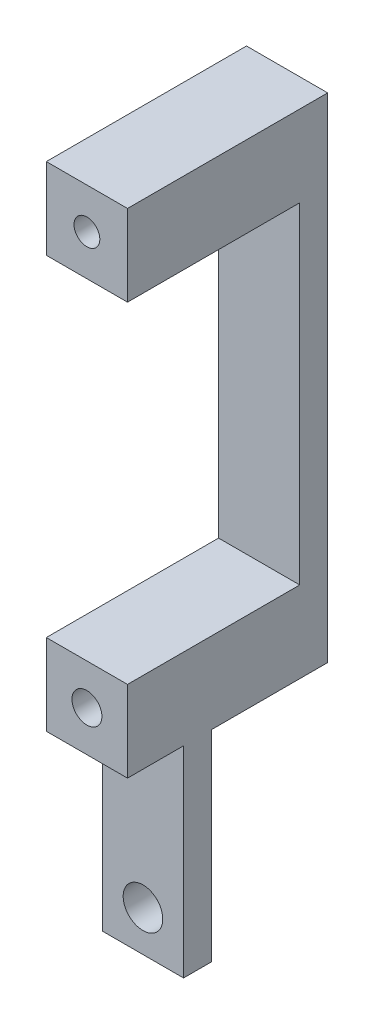
ISO-10303-21;
HEADER;
FILE_DESCRIPTION(('STEP AP214'),'2;1');
FILE_NAME('part.step','',(''),(''),'','','');
FILE_SCHEMA(('AUTOMOTIVE_DESIGN { 1 0 10303 214 1 1 1 1 }'));
ENDSEC;
DATA;
#1=APPLICATION_CONTEXT('core data for automotive mechanical design processes');
#2=APPLICATION_PROTOCOL_DEFINITION('international standard','automotive_design',2000,#1);
#3=PRODUCT_CONTEXT('',#1,'mechanical');
#4=PRODUCT('Part','Part','',(#3));
#5=PRODUCT_RELATED_PRODUCT_CATEGORY('part','',(#4));
#6=PRODUCT_DEFINITION_FORMATION('','',#4);
#7=PRODUCT_DEFINITION_CONTEXT('part definition',#1,'design');
#8=PRODUCT_DEFINITION('design','',#6,#7);
#9=PRODUCT_DEFINITION_SHAPE('','',#8);
#10=(LENGTH_UNIT() NAMED_UNIT(*) SI_UNIT(.MILLI.,.METRE.));
#11=(NAMED_UNIT(*) PLANE_ANGLE_UNIT() SI_UNIT($,.RADIAN.));
#12=(NAMED_UNIT(*) SI_UNIT($,.STERADIAN.) SOLID_ANGLE_UNIT());
#13=UNCERTAINTY_MEASURE_WITH_UNIT(LENGTH_MEASURE(1.E-05),#10,'distance_accuracy_value','');
#14=(GEOMETRIC_REPRESENTATION_CONTEXT(3) GLOBAL_UNCERTAINTY_ASSIGNED_CONTEXT((#13)) GLOBAL_UNIT_ASSIGNED_CONTEXT((#10,
#11,#12)) REPRESENTATION_CONTEXT('',''));
#15=CARTESIAN_POINT('',(0.,0.,0.));
#16=DIRECTION('',(0.,0.,1.));
#17=DIRECTION('',(1.,0.,0.));
#18=AXIS2_PLACEMENT_3D('',#15,#16,#17);
#19=CARTESIAN_POINT('',(0.,118.4148,-15.0495));
#20=DIRECTION('',(0.,0.,-1.));
#21=DIRECTION('',(-1.,0.,0.));
#22=AXIS2_PLACEMENT_3D('',#19,#20,#21);
#23=PLANE('',#22);
#24=DIRECTION('',(1.,0.,0.));
#25=VECTOR('',#24,1.);
#26=CARTESIAN_POINT('',(0.,104.5718,-15.0495));
#27=LINE('',#26,#25);
#28=CARTESIAN_POINT('',(0.,104.5718,-15.0495));
#29=VERTEX_POINT('',#28);
#30=CARTESIAN_POINT('',(13.843,104.5718,-15.0495));
#31=VERTEX_POINT('',#30);
#32=EDGE_CURVE('E269',#29,#31,#27,.T.);
#33=ORIENTED_EDGE('',*,*,#32,.F.);
#34=DIRECTION('',(0.,-1.,0.));
#35=VECTOR('',#34,1.);
#36=CARTESIAN_POINT('',(0.,118.4148,-15.0495));
#37=LINE('',#36,#35);
#38=CARTESIAN_POINT('',(0.,48.133,-15.0495));
#39=VERTEX_POINT('',#38);
#40=EDGE_CURVE('E64',#29,#39,#37,.T.);
#41=ORIENTED_EDGE('',*,*,#40,.T.);
#42=DIRECTION('',(1.,0.,0.));
#43=VECTOR('',#42,1.);
#44=CARTESIAN_POINT('',(0.,48.133,-15.0495));
#45=LINE('',#44,#43);
#46=CARTESIAN_POINT('',(13.843,48.133,-15.0495));
#47=VERTEX_POINT('',#46);
#48=EDGE_CURVE('E305',#39,#47,#45,.T.);
#49=ORIENTED_EDGE('',*,*,#48,.T.);
#50=DIRECTION('',(0.,-1.,0.));
#51=VECTOR('',#50,1.);
#52=CARTESIAN_POINT('',(13.843,118.4148,-15.0495));
#53=LINE('',#52,#51);
#54=EDGE_CURVE('E317',#31,#47,#53,.T.);
#55=ORIENTED_EDGE('',*,*,#54,.F.);
#56=EDGE_LOOP('',(#33,#41,#49,#55));
#57=FACE_BOUND('',#56,.T.);
#58=ADVANCED_FACE('F39',(#57),#23,.F.);
#59=CARTESIAN_POINT('',(0.,48.133,4.7625));
#60=DIRECTION('',(0.,-1.,0.));
#61=DIRECTION('',(0.,0.,-1.));
#62=AXIS2_PLACEMENT_3D('',#59,#60,#61);
#63=PLANE('',#62);
#64=ORIENTED_EDGE('',*,*,#48,.F.);
#65=DIRECTION('',(0.,0.,-1.));
#66=VECTOR('',#65,1.);
#67=CARTESIAN_POINT('',(0.,48.133,4.7625));
#68=LINE('',#67,#66);
#69=CARTESIAN_POINT('',(0.,48.133,14.31925));
#70=VERTEX_POINT('',#69);
#71=EDGE_CURVE('E462',#70,#39,#68,.T.);
#72=ORIENTED_EDGE('',*,*,#71,.F.);
#73=DIRECTION('',(-1.,0.,0.));
#74=VECTOR('',#73,1.);
#75=CARTESIAN_POINT('',(0.,48.133,14.31925));
#76=LINE('',#75,#74);
#77=CARTESIAN_POINT('',(13.843,48.133,14.31925));
#78=VERTEX_POINT('',#77);
#79=EDGE_CURVE('E436',#78,#70,#76,.T.);
#80=ORIENTED_EDGE('',*,*,#79,.F.);
#81=DIRECTION('',(0.,0.,-1.));
#82=VECTOR('',#81,1.);
#83=CARTESIAN_POINT('',(13.843,48.133,4.7625));
#84=LINE('',#83,#82);
#85=EDGE_CURVE('E474',#78,#47,#84,.T.);
#86=ORIENTED_EDGE('',*,*,#85,.T.);
#87=EDGE_LOOP('',(#64,#72,#80,#86));
#88=FACE_BOUND('',#87,.T.);
#89=ADVANCED_FACE('F515',(#88),#63,.F.);
#90=CARTESIAN_POINT('',(0.,0.,4.7625));
#91=DIRECTION('',(0.,0.,-1.));
#92=DIRECTION('',(-1.,0.,0.));
#93=AXIS2_PLACEMENT_3D('',#90,#91,#92);
#94=PLANE('',#93);
#95=CARTESIAN_POINT('',(6.9215,6.9215,4.7625));
#96=DIRECTION('',(0.,0.,-1.));
#97=DIRECTION('',(-1.,0.,0.));
#98=AXIS2_PLACEMENT_3D('',#95,#96,#97);
#99=CIRCLE('',#98,3.3782);
#100=CARTESIAN_POINT('',(3.5433,6.9215,4.7625));
#101=VERTEX_POINT('',#100);
#102=EDGE_CURVE('E420',#101,#101,#99,.T.);
#103=ORIENTED_EDGE('',*,*,#102,.T.);
#104=EDGE_LOOP('',(#103));
#105=FACE_BOUND('',#104,.T.);
#106=DIRECTION('',(1.,0.,0.));
#107=VECTOR('',#106,1.);
#108=CARTESIAN_POINT('',(0.,34.29,4.7625));
#109=LINE('',#108,#107);
#110=CARTESIAN_POINT('',(0.,34.29,4.7625));
#111=VERTEX_POINT('',#110);
#112=CARTESIAN_POINT('',(13.843,34.29,4.7625));
#113=VERTEX_POINT('',#112);
#114=EDGE_CURVE('E424',#111,#113,#109,.T.);
#115=ORIENTED_EDGE('',*,*,#114,.F.);
#116=DIRECTION('',(0.,-1.,0.));
#117=VECTOR('',#116,1.);
#118=CARTESIAN_POINT('',(0.,0.,4.7625));
#119=LINE('',#118,#117);
#120=CARTESIAN_POINT('',(0.,0.,4.7625));
#121=VERTEX_POINT('',#120);
#122=EDGE_CURVE('E452',#111,#121,#119,.T.);
#123=ORIENTED_EDGE('',*,*,#122,.T.);
#124=DIRECTION('',(1.,0.,0.));
#125=VECTOR('',#124,1.);
#126=CARTESIAN_POINT('',(0.,0.,4.7625));
#127=LINE('',#126,#125);
#128=CARTESIAN_POINT('',(13.843,0.,4.7625));
#129=VERTEX_POINT('',#128);
#130=EDGE_CURVE('E455',#121,#129,#127,.T.);
#131=ORIENTED_EDGE('',*,*,#130,.T.);
#132=DIRECTION('',(0.,1.,0.));
#133=VECTOR('',#132,1.);
#134=CARTESIAN_POINT('',(13.843,0.,4.7625));
#135=LINE('',#134,#133);
#136=EDGE_CURVE('E459',#129,#113,#135,.T.);
#137=ORIENTED_EDGE('',*,*,#136,.T.);
#138=EDGE_LOOP('',(#115,#123,#131,#137));
#139=FACE_BOUND('',#138,.T.);
#140=ADVANCED_FACE('F527',(#105,#139),#94,.F.);
#141=CARTESIAN_POINT('',(0.,0.,4.7625));
#142=DIRECTION('',(1.,0.,0.));
#143=DIRECTION('',(0.,0.,-1.));
#144=AXIS2_PLACEMENT_3D('',#141,#142,#143);
#145=PLANE('',#144);
#146=ORIENTED_EDGE('',*,*,#71,.T.);
#147=ORIENTED_EDGE('',*,*,#40,.F.);
#148=DIRECTION('',(0.,0.,-1.));
#149=VECTOR('',#148,1.);
#150=CARTESIAN_POINT('',(0.,104.5718,14.31925));
#151=LINE('',#150,#149);
#152=CARTESIAN_POINT('',(0.,104.5718,14.31925));
#153=VERTEX_POINT('',#152);
#154=EDGE_CURVE('E302',#153,#29,#151,.T.);
#155=ORIENTED_EDGE('',*,*,#154,.F.);
#156=DIRECTION('',(0.,-1.,0.));
#157=VECTOR('',#156,1.);
#158=CARTESIAN_POINT('',(0.,118.4148,14.31925));
#159=LINE('',#158,#157);
#160=CARTESIAN_POINT('',(0.,118.4148,14.31925));
#161=VERTEX_POINT('',#160);
#162=EDGE_CURVE('E281',#161,#153,#159,.T.);
#163=ORIENTED_EDGE('',*,*,#162,.F.);
#164=DIRECTION('',(0.,0.,1.));
#165=VECTOR('',#164,1.);
#166=CARTESIAN_POINT('',(0.,118.4148,-19.812));
#167=LINE('',#166,#165);
#168=CARTESIAN_POINT('',(0.,118.4148,-19.812));
#169=VERTEX_POINT('',#168);
#170=EDGE_CURVE('E306',#169,#161,#167,.T.);
#171=ORIENTED_EDGE('',*,*,#170,.F.);
#172=DIRECTION('',(0.,1.,0.));
#173=VECTOR('',#172,1.);
#174=CARTESIAN_POINT('',(0.,48.133,-19.812));
#175=LINE('',#174,#173);
#176=CARTESIAN_POINT('',(0.,34.29,-19.812));
#177=VERTEX_POINT('',#176);
#178=EDGE_CURVE('E399',#177,#169,#175,.T.);
#179=ORIENTED_EDGE('',*,*,#178,.F.);
#180=DIRECTION('',(0.,0.,1.));
#181=VECTOR('',#180,1.);
#182=CARTESIAN_POINT('',(0.,34.29,-19.812));
#183=LINE('',#182,#181);
#184=CARTESIAN_POINT('',(0.,34.29,0.));
#185=VERTEX_POINT('',#184);
#186=EDGE_CURVE('E402',#177,#185,#183,.T.);
#187=ORIENTED_EDGE('',*,*,#186,.T.);
#188=DIRECTION('',(0.,-1.,0.));
#189=VECTOR('',#188,1.);
#190=CARTESIAN_POINT('',(0.,0.,0.));
#191=LINE('',#190,#189);
#192=CARTESIAN_POINT('',(0.,0.,0.));
#193=VERTEX_POINT('',#192);
#194=EDGE_CURVE('E451',#185,#193,#191,.T.);
#195=ORIENTED_EDGE('',*,*,#194,.T.);
#196=DIRECTION('',(0.,0.,-1.));
#197=VECTOR('',#196,1.);
#198=CARTESIAN_POINT('',(0.,0.,4.7625));
#199=LINE('',#198,#197);
#200=EDGE_CURVE('E11',#121,#193,#199,.T.);
#201=ORIENTED_EDGE('',*,*,#200,.F.);
#202=ORIENTED_EDGE('',*,*,#122,.F.);
#203=DIRECTION('',(0.,0.,-1.));
#204=VECTOR('',#203,1.);
#205=CARTESIAN_POINT('',(0.,34.29,14.31925));
#206=LINE('',#205,#204);
#207=CARTESIAN_POINT('',(0.,34.29,14.31925));
#208=VERTEX_POINT('',#207);
#209=EDGE_CURVE('E447',#208,#111,#206,.T.);
#210=ORIENTED_EDGE('',*,*,#209,.F.);
#211=DIRECTION('',(0.,-1.,0.));
#212=VECTOR('',#211,1.);
#213=CARTESIAN_POINT('',(0.,48.133,14.31925));
#214=LINE('',#213,#212);
#215=EDGE_CURVE('E425',#70,#208,#214,.T.);
#216=ORIENTED_EDGE('',*,*,#215,.F.);
#217=EDGE_LOOP('',(#146,#147,#155,#163,#171,#179,#187,#195,#201,#202,#210,#216));
#218=FACE_BOUND('',#217,.T.);
#219=ADVANCED_FACE('F41',(#218),#145,.F.);
#220=CARTESIAN_POINT('',(0.,0.,4.7625));
#221=DIRECTION('',(0.,1.,0.));
#222=DIRECTION('',(0.,0.,1.));
#223=AXIS2_PLACEMENT_3D('',#220,#221,#222);
#224=PLANE('',#223);
#225=DIRECTION('',(1.,0.,0.));
#226=VECTOR('',#225,1.);
#227=CARTESIAN_POINT('',(0.,0.,0.));
#228=LINE('',#227,#226);
#229=CARTESIAN_POINT('',(13.843,0.,0.));
#230=VERTEX_POINT('',#229);
#231=EDGE_CURVE('E465',#193,#230,#228,.T.);
#232=ORIENTED_EDGE('',*,*,#231,.T.);
#233=DIRECTION('',(0.,0.,-1.));
#234=VECTOR('',#233,1.);
#235=CARTESIAN_POINT('',(13.843,0.,4.7625));
#236=LINE('',#235,#234);
#237=EDGE_CURVE('E49',#129,#230,#236,.T.);
#238=ORIENTED_EDGE('',*,*,#237,.F.);
#239=ORIENTED_EDGE('',*,*,#130,.F.);
#240=ORIENTED_EDGE('',*,*,#200,.T.);
#241=EDGE_LOOP('',(#232,#238,#239,#240));
#242=FACE_BOUND('',#241,.T.);
#243=ADVANCED_FACE('F528',(#242),#224,.F.);
#244=CARTESIAN_POINT('',(13.843,0.,4.7625));
#245=DIRECTION('',(-1.,0.,0.));
#246=DIRECTION('',(0.,0.,1.));
#247=AXIS2_PLACEMENT_3D('',#244,#245,#246);
#248=PLANE('',#247);
#249=DIRECTION('',(0.,1.,0.));
#250=VECTOR('',#249,1.);
#251=CARTESIAN_POINT('',(13.843,0.,0.));
#252=LINE('',#251,#250);
#253=CARTESIAN_POINT('',(13.843,34.29,0.));
#254=VERTEX_POINT('',#253);
#255=EDGE_CURVE('E456',#230,#254,#252,.T.);
#256=ORIENTED_EDGE('',*,*,#255,.T.);
#257=DIRECTION('',(0.,0.,1.));
#258=VECTOR('',#257,1.);
#259=CARTESIAN_POINT('',(13.843,34.29,-19.812));
#260=LINE('',#259,#258);
#261=CARTESIAN_POINT('',(13.843,34.29,-19.812));
#262=VERTEX_POINT('',#261);
#263=EDGE_CURVE('E409',#262,#254,#260,.T.);
#264=ORIENTED_EDGE('',*,*,#263,.F.);
#265=DIRECTION('',(0.,-1.,0.));
#266=VECTOR('',#265,1.);
#267=CARTESIAN_POINT('',(13.843,48.133,-19.812));
#268=LINE('',#267,#266);
#269=CARTESIAN_POINT('',(13.843,118.4148,-19.812));
#270=VERTEX_POINT('',#269);
#271=EDGE_CURVE('E391',#270,#262,#268,.T.);
#272=ORIENTED_EDGE('',*,*,#271,.F.);
#273=DIRECTION('',(0.,0.,-1.));
#274=VECTOR('',#273,1.);
#275=CARTESIAN_POINT('',(13.843,118.4148,-19.812));
#276=LINE('',#275,#274);
#277=CARTESIAN_POINT('',(13.843,118.4148,14.31925));
#278=VERTEX_POINT('',#277);
#279=EDGE_CURVE('E309',#278,#270,#276,.T.);
#280=ORIENTED_EDGE('',*,*,#279,.F.);
#281=DIRECTION('',(0.,1.,0.));
#282=VECTOR('',#281,1.);
#283=CARTESIAN_POINT('',(13.843,118.4148,14.31925));
#284=LINE('',#283,#282);
#285=CARTESIAN_POINT('',(13.843,104.5718,14.31925));
#286=VERTEX_POINT('',#285);
#287=EDGE_CURVE('E288',#286,#278,#284,.T.);
#288=ORIENTED_EDGE('',*,*,#287,.F.);
#289=DIRECTION('',(0.,0.,-1.));
#290=VECTOR('',#289,1.);
#291=CARTESIAN_POINT('',(13.843,104.5718,14.31925));
#292=LINE('',#291,#290);
#293=EDGE_CURVE('E296',#286,#31,#292,.T.);
#294=ORIENTED_EDGE('',*,*,#293,.T.);
#295=ORIENTED_EDGE('',*,*,#54,.T.);
#296=ORIENTED_EDGE('',*,*,#85,.F.);
#297=DIRECTION('',(0.,1.,0.));
#298=VECTOR('',#297,1.);
#299=CARTESIAN_POINT('',(13.843,48.133,14.31925));
#300=LINE('',#299,#298);
#301=CARTESIAN_POINT('',(13.843,34.29,14.31925));
#302=VERTEX_POINT('',#301);
#303=EDGE_CURVE('E432',#302,#78,#300,.T.);
#304=ORIENTED_EDGE('',*,*,#303,.F.);
#305=DIRECTION('',(0.,0.,-1.));
#306=VECTOR('',#305,1.);
#307=CARTESIAN_POINT('',(13.843,34.29,14.31925));
#308=LINE('',#307,#306);
#309=EDGE_CURVE('E440',#302,#113,#308,.T.);
#310=ORIENTED_EDGE('',*,*,#309,.T.);
#311=ORIENTED_EDGE('',*,*,#136,.F.);
#312=ORIENTED_EDGE('',*,*,#237,.T.);
#313=EDGE_LOOP('',(#256,#264,#272,#280,#288,#294,#295,#296,#304,#310,#311,#312));
#314=FACE_BOUND('',#313,.T.);
#315=ADVANCED_FACE('F484',(#314),#248,.F.);
#316=CARTESIAN_POINT('',(0.,0.,0.));
#317=DIRECTION('',(0.,0.,-1.));
#318=DIRECTION('',(-1.,0.,0.));
#319=AXIS2_PLACEMENT_3D('',#316,#317,#318);
#320=PLANE('',#319);
#321=DIRECTION('',(-1.,0.,0.));
#322=VECTOR('',#321,1.);
#323=CARTESIAN_POINT('',(13.843,34.29,0.));
#324=LINE('',#323,#322);
#325=EDGE_CURVE('E396',#254,#185,#324,.T.);
#326=ORIENTED_EDGE('',*,*,#325,.F.);
#327=ORIENTED_EDGE('',*,*,#255,.F.);
#328=ORIENTED_EDGE('',*,*,#231,.F.);
#329=ORIENTED_EDGE('',*,*,#194,.F.);
#330=EDGE_LOOP('',(#326,#327,#328,#329));
#331=FACE_BOUND('',#330,.T.);
#332=CARTESIAN_POINT('',(6.9215,6.9215,0.));
#333=DIRECTION('',(0.,0.,-1.));
#334=DIRECTION('',(-1.,0.,0.));
#335=AXIS2_PLACEMENT_3D('',#332,#333,#334);
#336=CIRCLE('',#335,3.3782);
#337=CARTESIAN_POINT('',(3.5433,6.9215,0.));
#338=VERTEX_POINT('',#337);
#339=EDGE_CURVE('E416',#338,#338,#336,.T.);
#340=ORIENTED_EDGE('',*,*,#339,.F.);
#341=EDGE_LOOP('',(#340));
#342=FACE_BOUND('',#341,.T.);
#343=ADVANCED_FACE('F490',(#331,#342),#320,.T.);
#344=CARTESIAN_POINT('',(0.,34.29,14.31925));
#345=DIRECTION('',(0.,1.,0.));
#346=DIRECTION('',(0.,0.,1.));
#347=AXIS2_PLACEMENT_3D('',#344,#345,#346);
#348=PLANE('',#347);
#349=ORIENTED_EDGE('',*,*,#114,.T.);
#350=ORIENTED_EDGE('',*,*,#309,.F.);
#351=DIRECTION('',(1.,0.,0.));
#352=VECTOR('',#351,1.);
#353=CARTESIAN_POINT('',(0.,34.29,14.31925));
#354=LINE('',#353,#352);
#355=EDGE_CURVE('E429',#208,#302,#354,.T.);
#356=ORIENTED_EDGE('',*,*,#355,.F.);
#357=ORIENTED_EDGE('',*,*,#209,.T.);
#358=EDGE_LOOP('',(#349,#350,#356,#357));
#359=FACE_BOUND('',#358,.T.);
#360=ADVANCED_FACE('F525',(#359),#348,.F.);
#361=CARTESIAN_POINT('',(0.,0.,14.31925));
#362=DIRECTION('',(0.,0.,1.));
#363=DIRECTION('',(1.,0.,0.));
#364=AXIS2_PLACEMENT_3D('',#361,#362,#363);
#365=PLANE('',#364);
#366=CARTESIAN_POINT('',(6.9215,41.2115,14.31925));
#367=DIRECTION('',(0.,0.,1.));
#368=DIRECTION('',(1.,0.,0.));
#369=AXIS2_PLACEMENT_3D('',#366,#367,#368);
#370=CIRCLE('',#369,2.5527);
#371=CARTESIAN_POINT('',(9.4742,41.2115,14.31925));
#372=VERTEX_POINT('',#371);
#373=EDGE_CURVE('E43',#372,#372,#370,.T.);
#374=ORIENTED_EDGE('',*,*,#373,.F.);
#375=EDGE_LOOP('',(#374));
#376=FACE_BOUND('',#375,.T.);
#377=ORIENTED_EDGE('',*,*,#215,.T.);
#378=ORIENTED_EDGE('',*,*,#355,.T.);
#379=ORIENTED_EDGE('',*,*,#303,.T.);
#380=ORIENTED_EDGE('',*,*,#79,.T.);
#381=EDGE_LOOP('',(#377,#378,#379,#380));
#382=FACE_BOUND('',#381,.T.);
#383=ADVANCED_FACE('F521',(#376,#382),#365,.T.);
#384=CARTESIAN_POINT('',(6.9215,6.9215,9.55675));
#385=DIRECTION('',(0.,0.,-1.));
#386=DIRECTION('',(-1.,0.,0.));
#387=AXIS2_PLACEMENT_3D('',#384,#385,#386);
#388=CYLINDRICAL_SURFACE('',#387,3.3782);
#389=ORIENTED_EDGE('',*,*,#339,.T.);
#390=EDGE_LOOP('',(#389));
#391=FACE_BOUND('',#390,.T.);
#392=ORIENTED_EDGE('',*,*,#102,.F.);
#393=EDGE_LOOP('',(#392));
#394=FACE_BOUND('',#393,.T.);
#395=ADVANCED_FACE('F580',(#391,#394),#388,.F.);
#396=CARTESIAN_POINT('',(6.9215,41.2115,16.92275));
#397=DIRECTION('',(0.,0.,-1.));
#398=DIRECTION('',(-1.,0.,0.));
#399=AXIS2_PLACEMENT_3D('',#396,#397,#398);
#400=CYLINDRICAL_SURFACE('',#399,2.5527);
#401=ORIENTED_EDGE('',*,*,#373,.T.);
#402=EDGE_LOOP('',(#401));
#403=FACE_BOUND('',#402,.T.);
#404=CARTESIAN_POINT('',(6.9215,41.2115,0.));
#405=DIRECTION('',(0.,0.,-1.));
#406=DIRECTION('',(-1.,0.,0.));
#407=AXIS2_PLACEMENT_3D('',#404,#405,#406);
#408=CIRCLE('',#407,2.5527);
#409=CARTESIAN_POINT('',(4.3688,41.2115,0.));
#410=VERTEX_POINT('',#409);
#411=EDGE_CURVE('E375',#410,#410,#408,.T.);
#412=ORIENTED_EDGE('',*,*,#411,.T.);
#413=EDGE_LOOP('',(#412));
#414=FACE_BOUND('',#413,.T.);
#415=ADVANCED_FACE('F574',(#403,#414),#400,.F.);
#416=CARTESIAN_POINT('',(0.,0.,-19.812));
#417=DIRECTION('',(0.,0.,-1.));
#418=DIRECTION('',(-1.,0.,0.));
#419=AXIS2_PLACEMENT_3D('',#416,#417,#418);
#420=PLANE('',#419);
#421=DIRECTION('',(1.,0.,0.));
#422=VECTOR('',#421,1.);
#423=CARTESIAN_POINT('',(4.84644539750557,115.0874,-19.812));
#424=LINE('',#423,#422);
#425=CARTESIAN_POINT('',(4.84644539750557,115.0874,-19.812));
#426=VERTEX_POINT('',#425);
#427=CARTESIAN_POINT('',(8.99655460249444,115.0874,-19.812));
#428=VERTEX_POINT('',#427);
#429=EDGE_CURVE('E56',#426,#428,#424,.T.);
#430=ORIENTED_EDGE('',*,*,#429,.F.);
#431=DIRECTION('',(0.500000000000001,0.866025403784438,0.));
#432=VECTOR('',#431,1.);
#433=CARTESIAN_POINT('',(2.77139079501114,111.4933,-19.812));
#434=LINE('',#433,#432);
#435=CARTESIAN_POINT('',(2.77139079501114,111.4933,-19.812));
#436=VERTEX_POINT('',#435);
#437=EDGE_CURVE('E228',#436,#426,#434,.T.);
#438=ORIENTED_EDGE('',*,*,#437,.F.);
#439=DIRECTION('',(-0.499999999999999,0.866025403784439,0.));
#440=VECTOR('',#439,1.);
#441=CARTESIAN_POINT('',(4.84644539750557,107.8992,-19.812));
#442=LINE('',#441,#440);
#443=CARTESIAN_POINT('',(4.84644539750557,107.8992,-19.812));
#444=VERTEX_POINT('',#443);
#445=EDGE_CURVE('E232',#444,#436,#442,.T.);
#446=ORIENTED_EDGE('',*,*,#445,.F.);
#447=DIRECTION('',(-1.,0.,0.));
#448=VECTOR('',#447,1.);
#449=CARTESIAN_POINT('',(8.99655460249443,107.8992,-19.812));
#450=LINE('',#449,#448);
#451=CARTESIAN_POINT('',(8.99655460249443,107.8992,-19.812));
#452=VERTEX_POINT('',#451);
#453=EDGE_CURVE('E259',#452,#444,#450,.T.);
#454=ORIENTED_EDGE('',*,*,#453,.F.);
#455=DIRECTION('',(-0.5,-0.866025403784439,0.));
#456=VECTOR('',#455,1.);
#457=CARTESIAN_POINT('',(11.0716092049889,111.4933,-19.812));
#458=LINE('',#457,#456);
#459=CARTESIAN_POINT('',(11.0716092049889,111.4933,-19.812));
#460=VERTEX_POINT('',#459);
#461=EDGE_CURVE('E255',#460,#452,#458,.T.);
#462=ORIENTED_EDGE('',*,*,#461,.F.);
#463=DIRECTION('',(0.499999999999999,-0.866025403784439,0.));
#464=VECTOR('',#463,1.);
#465=CARTESIAN_POINT('',(8.99655460249445,115.0874,-19.812));
#466=LINE('',#465,#464);
#467=EDGE_CURVE('E251',#428,#460,#466,.T.);
#468=ORIENTED_EDGE('',*,*,#467,.F.);
#469=EDGE_LOOP('',(#430,#438,#446,#454,#462,#468));
#470=FACE_BOUND('',#469,.T.);
#471=DIRECTION('',(0.999999948654788,0.000320453460830516,0.));
#472=VECTOR('',#471,1.);
#473=CARTESIAN_POINT('',(4.10798377324756,46.081048649016,-19.812));
#474=LINE('',#473,#472);
#475=CARTESIAN_POINT('',(4.10798377324756,46.081048649016,-19.812));
#476=VERTEX_POINT('',#475);
#477=CARTESIAN_POINT('',(9.73189472163586,46.0828508508354,-19.812));
#478=VERTEX_POINT('',#477);
#479=EDGE_CURVE('E324',#476,#478,#474,.T.);
#480=ORIENTED_EDGE('',*,*,#479,.F.);
#481=DIRECTION('',(0.499722453489584,0.866185586048596,0.));
#482=VECTOR('',#481,1.);
#483=CARTESIAN_POINT('',(1.2975890516117,41.2096977981806,-19.812));
#484=LINE('',#483,#482);
#485=CARTESIAN_POINT('',(1.2975890516117,41.2096977981806,-19.812));
#486=VERTEX_POINT('',#485);
#487=EDGE_CURVE('E330',#486,#476,#484,.T.);
#488=ORIENTED_EDGE('',*,*,#487,.F.);
#489=DIRECTION('',(-0.500277495165204,0.865865132587766,0.));
#490=VECTOR('',#489,1.);
#491=CARTESIAN_POINT('',(4.11110527836415,36.3401491491646,-19.812));
#492=LINE('',#491,#490);
#493=CARTESIAN_POINT('',(4.11110527836415,36.3401491491646,-19.812));
#494=VERTEX_POINT('',#493);
#495=EDGE_CURVE('E365',#494,#486,#492,.T.);
#496=ORIENTED_EDGE('',*,*,#495,.F.);
#497=DIRECTION('',(-0.999999948654788,-0.000320453460830515,0.));
#498=VECTOR('',#497,1.);
#499=CARTESIAN_POINT('',(9.73501622675246,36.341951350984,-19.812));
#500=LINE('',#499,#498);
#501=CARTESIAN_POINT('',(9.73501622675246,36.341951350984,-19.812));
#502=VERTEX_POINT('',#501);
#503=EDGE_CURVE('E361',#502,#494,#500,.T.);
#504=ORIENTED_EDGE('',*,*,#503,.F.);
#505=DIRECTION('',(-0.499722453489585,-0.866185586048596,0.));
#506=VECTOR('',#505,1.);
#507=CARTESIAN_POINT('',(12.5454109483883,41.2133022018193,-19.812));
#508=LINE('',#507,#506);
#509=CARTESIAN_POINT('',(12.5454109483883,41.2133022018193,-19.812));
#510=VERTEX_POINT('',#509);
#511=EDGE_CURVE('E357',#510,#502,#508,.T.);
#512=ORIENTED_EDGE('',*,*,#511,.F.);
#513=DIRECTION('',(0.500277495165203,-0.865865132587766,0.));
#514=VECTOR('',#513,1.);
#515=CARTESIAN_POINT('',(9.73189472163586,46.0828508508354,-19.812));
#516=LINE('',#515,#514);
#517=EDGE_CURVE('E353',#478,#510,#516,.T.);
#518=ORIENTED_EDGE('',*,*,#517,.F.);
#519=EDGE_LOOP('',(#480,#488,#496,#504,#512,#518));
#520=FACE_BOUND('',#519,.T.);
#521=ORIENTED_EDGE('',*,*,#271,.T.);
#522=DIRECTION('',(-1.,0.,0.));
#523=VECTOR('',#522,1.);
#524=CARTESIAN_POINT('',(13.843,34.29,-19.812));
#525=LINE('',#524,#523);
#526=EDGE_CURVE('E395',#262,#177,#525,.T.);
#527=ORIENTED_EDGE('',*,*,#526,.T.);
#528=ORIENTED_EDGE('',*,*,#178,.T.);
#529=DIRECTION('',(-1.,0.,0.));
#530=VECTOR('',#529,1.);
#531=CARTESIAN_POINT('',(0.,118.4148,-19.812));
#532=LINE('',#531,#530);
#533=EDGE_CURVE('E313',#270,#169,#532,.T.);
#534=ORIENTED_EDGE('',*,*,#533,.F.);
#535=EDGE_LOOP('',(#521,#527,#528,#534));
#536=FACE_BOUND('',#535,.T.);
#537=ADVANCED_FACE('F502',(#470,#520,#536),#420,.T.);
#538=CARTESIAN_POINT('',(13.843,34.29,-19.812));
#539=DIRECTION('',(0.,1.,0.));
#540=DIRECTION('',(0.,0.,1.));
#541=AXIS2_PLACEMENT_3D('',#538,#539,#540);
#542=PLANE('',#541);
#543=ORIENTED_EDGE('',*,*,#325,.T.);
#544=ORIENTED_EDGE('',*,*,#186,.F.);
#545=ORIENTED_EDGE('',*,*,#526,.F.);
#546=ORIENTED_EDGE('',*,*,#263,.T.);
#547=EDGE_LOOP('',(#543,#544,#545,#546));
#548=FACE_BOUND('',#547,.T.);
#549=ADVANCED_FACE('F494',(#548),#542,.F.);
#550=CARTESIAN_POINT('',(4.10798377324756,46.081048649016,0.));
#551=DIRECTION('',(-0.000320453460830516,0.999999948654788,0.));
#552=DIRECTION('',(-0.999999948654788,-0.000320453460830516,0.));
#553=AXIS2_PLACEMENT_3D('',#550,#551,#552);
#554=PLANE('',#553);
#555=ORIENTED_EDGE('',*,*,#479,.T.);
#556=DIRECTION('',(0.,0.,-1.));
#557=VECTOR('',#556,1.);
#558=CARTESIAN_POINT('',(9.73189472163586,46.0828508508354,0.));
#559=LINE('',#558,#557);
#560=CARTESIAN_POINT('',(9.73189472163586,46.0828508508354,0.));
#561=VERTEX_POINT('',#560);
#562=EDGE_CURVE('E350',#561,#478,#559,.T.);
#563=ORIENTED_EDGE('',*,*,#562,.F.);
#564=DIRECTION('',(0.999999948654788,0.000320453460830516,0.));
#565=VECTOR('',#564,1.);
#566=CARTESIAN_POINT('',(4.10798377324756,46.081048649016,0.));
#567=LINE('',#566,#565);
#568=CARTESIAN_POINT('',(4.10798377324756,46.081048649016,0.));
#569=VERTEX_POINT('',#568);
#570=EDGE_CURVE('E325',#569,#561,#567,.T.);
#571=ORIENTED_EDGE('',*,*,#570,.F.);
#572=DIRECTION('',(0.,0.,-1.));
#573=VECTOR('',#572,1.);
#574=CARTESIAN_POINT('',(4.10798377324756,46.081048649016,0.));
#575=LINE('',#574,#573);
#576=EDGE_CURVE('E372',#569,#476,#575,.T.);
#577=ORIENTED_EDGE('',*,*,#576,.T.);
#578=EDGE_LOOP('',(#555,#563,#571,#577));
#579=FACE_BOUND('',#578,.T.);
#580=ADVANCED_FACE('F553',(#579),#554,.F.);
#581=CARTESIAN_POINT('',(1.2975890516117,41.2096977981806,0.));
#582=DIRECTION('',(-0.866185586048597,0.499722453489584,0.));
#583=DIRECTION('',(-0.499722453489584,-0.866185586048597,0.));
#584=AXIS2_PLACEMENT_3D('',#581,#582,#583);
#585=PLANE('',#584);
#586=ORIENTED_EDGE('',*,*,#487,.T.);
#587=ORIENTED_EDGE('',*,*,#576,.F.);
#588=DIRECTION('',(0.499722453489584,0.866185586048596,0.));
#589=VECTOR('',#588,1.);
#590=CARTESIAN_POINT('',(1.2975890516117,41.2096977981806,0.));
#591=LINE('',#590,#589);
#592=CARTESIAN_POINT('',(1.2975890516117,41.2096977981806,0.));
#593=VERTEX_POINT('',#592);
#594=EDGE_CURVE('E346',#593,#569,#591,.T.);
#595=ORIENTED_EDGE('',*,*,#594,.F.);
#596=DIRECTION('',(0.,0.,-1.));
#597=VECTOR('',#596,1.);
#598=CARTESIAN_POINT('',(1.2975890516117,41.2096977981806,0.));
#599=LINE('',#598,#597);
#600=EDGE_CURVE('E376',#593,#486,#599,.T.);
#601=ORIENTED_EDGE('',*,*,#600,.T.);
#602=EDGE_LOOP('',(#586,#587,#595,#601));
#603=FACE_BOUND('',#602,.T.);
#604=ADVANCED_FACE('F549',(#603),#585,.F.);
#605=CARTESIAN_POINT('',(4.11110527836415,36.3401491491646,0.));
#606=DIRECTION('',(-0.865865132587766,-0.500277495165204,0.));
#607=DIRECTION('',(0.500277495165204,-0.865865132587766,0.));
#608=AXIS2_PLACEMENT_3D('',#605,#606,#607);
#609=PLANE('',#608);
#610=ORIENTED_EDGE('',*,*,#495,.T.);
#611=ORIENTED_EDGE('',*,*,#600,.F.);
#612=DIRECTION('',(-0.500277495165204,0.865865132587766,0.));
#613=VECTOR('',#612,1.);
#614=CARTESIAN_POINT('',(4.11110527836415,36.3401491491646,0.));
#615=LINE('',#614,#613);
#616=CARTESIAN_POINT('',(4.11110527836415,36.3401491491646,0.));
#617=VERTEX_POINT('',#616);
#618=EDGE_CURVE('E342',#617,#593,#615,.T.);
#619=ORIENTED_EDGE('',*,*,#618,.F.);
#620=DIRECTION('',(0.,0.,-1.));
#621=VECTOR('',#620,1.);
#622=CARTESIAN_POINT('',(4.11110527836415,36.3401491491646,0.));
#623=LINE('',#622,#621);
#624=EDGE_CURVE('E379',#617,#494,#623,.T.);
#625=ORIENTED_EDGE('',*,*,#624,.T.);
#626=EDGE_LOOP('',(#610,#611,#619,#625));
#627=FACE_BOUND('',#626,.T.);
#628=ADVANCED_FACE('F552',(#627),#609,.F.);
#629=CARTESIAN_POINT('',(9.73501622675246,36.341951350984,0.));
#630=DIRECTION('',(0.000320453460830515,-0.999999948654788,0.));
#631=DIRECTION('',(0.999999948654788,0.000320453460830515,0.));
#632=AXIS2_PLACEMENT_3D('',#629,#630,#631);
#633=PLANE('',#632);
#634=ORIENTED_EDGE('',*,*,#503,.T.);
#635=ORIENTED_EDGE('',*,*,#624,.F.);
#636=DIRECTION('',(-0.999999948654788,-0.000320453460830515,0.));
#637=VECTOR('',#636,1.);
#638=CARTESIAN_POINT('',(9.73501622675246,36.341951350984,0.));
#639=LINE('',#638,#637);
#640=CARTESIAN_POINT('',(9.73501622675246,36.341951350984,0.));
#641=VERTEX_POINT('',#640);
#642=EDGE_CURVE('E338',#641,#617,#639,.T.);
#643=ORIENTED_EDGE('',*,*,#642,.F.);
#644=DIRECTION('',(0.,0.,-1.));
#645=VECTOR('',#644,1.);
#646=CARTESIAN_POINT('',(9.73501622675246,36.341951350984,0.));
#647=LINE('',#646,#645);
#648=EDGE_CURVE('E382',#641,#502,#647,.T.);
#649=ORIENTED_EDGE('',*,*,#648,.T.);
#650=EDGE_LOOP('',(#634,#635,#643,#649));
#651=FACE_BOUND('',#650,.T.);
#652=ADVANCED_FACE('F557',(#651),#633,.F.);
#653=CARTESIAN_POINT('',(12.5454109483883,41.2133022018193,0.));
#654=DIRECTION('',(0.866185586048596,-0.499722453489585,0.));
#655=DIRECTION('',(0.499722453489585,0.866185586048596,0.));
#656=AXIS2_PLACEMENT_3D('',#653,#654,#655);
#657=PLANE('',#656);
#658=ORIENTED_EDGE('',*,*,#511,.T.);
#659=ORIENTED_EDGE('',*,*,#648,.F.);
#660=DIRECTION('',(-0.499722453489585,-0.866185586048596,0.));
#661=VECTOR('',#660,1.);
#662=CARTESIAN_POINT('',(12.5454109483883,41.2133022018193,0.));
#663=LINE('',#662,#661);
#664=CARTESIAN_POINT('',(12.5454109483883,41.2133022018193,0.));
#665=VERTEX_POINT('',#664);
#666=EDGE_CURVE('E334',#665,#641,#663,.T.);
#667=ORIENTED_EDGE('',*,*,#666,.F.);
#668=DIRECTION('',(0.,0.,-1.));
#669=VECTOR('',#668,1.);
#670=CARTESIAN_POINT('',(12.5454109483883,41.2133022018193,0.));
#671=LINE('',#670,#669);
#672=EDGE_CURVE('E385',#665,#510,#671,.T.);
#673=ORIENTED_EDGE('',*,*,#672,.T.);
#674=EDGE_LOOP('',(#658,#659,#667,#673));
#675=FACE_BOUND('',#674,.T.);
#676=ADVANCED_FACE('F561',(#675),#657,.F.);
#677=CARTESIAN_POINT('',(9.73189472163586,46.0828508508354,0.));
#678=DIRECTION('',(0.865865132587766,0.500277495165203,0.));
#679=DIRECTION('',(-0.500277495165203,0.865865132587766,0.));
#680=AXIS2_PLACEMENT_3D('',#677,#678,#679);
#681=PLANE('',#680);
#682=ORIENTED_EDGE('',*,*,#517,.T.);
#683=ORIENTED_EDGE('',*,*,#672,.F.);
#684=DIRECTION('',(0.500277495165203,-0.865865132587766,0.));
#685=VECTOR('',#684,1.);
#686=CARTESIAN_POINT('',(9.73189472163586,46.0828508508354,0.));
#687=LINE('',#686,#685);
#688=EDGE_CURVE('E329',#561,#665,#687,.T.);
#689=ORIENTED_EDGE('',*,*,#688,.F.);
#690=ORIENTED_EDGE('',*,*,#562,.T.);
#691=EDGE_LOOP('',(#682,#683,#689,#690));
#692=FACE_BOUND('',#691,.T.);
#693=ADVANCED_FACE('F547',(#692),#681,.F.);
#694=CARTESIAN_POINT('',(0.,0.,0.));
#695=DIRECTION('',(0.,0.,-1.));
#696=DIRECTION('',(-1.,0.,0.));
#697=AXIS2_PLACEMENT_3D('',#694,#695,#696);
#698=PLANE('',#697);
#699=ORIENTED_EDGE('',*,*,#411,.F.);
#700=EDGE_LOOP('',(#699));
#701=FACE_BOUND('',#700,.T.);
#702=ORIENTED_EDGE('',*,*,#570,.T.);
#703=ORIENTED_EDGE('',*,*,#688,.T.);
#704=ORIENTED_EDGE('',*,*,#666,.T.);
#705=ORIENTED_EDGE('',*,*,#642,.T.);
#706=ORIENTED_EDGE('',*,*,#618,.T.);
#707=ORIENTED_EDGE('',*,*,#594,.T.);
#708=EDGE_LOOP('',(#702,#703,#704,#705,#706,#707));
#709=FACE_BOUND('',#708,.T.);
#710=ADVANCED_FACE('F544',(#701,#709),#698,.T.);
#711=CARTESIAN_POINT('',(0.,118.4148,0.));
#712=DIRECTION('',(0.,1.,0.));
#713=DIRECTION('',(0.,0.,1.));
#714=AXIS2_PLACEMENT_3D('',#711,#712,#713);
#715=PLANE('',#714);
#716=ORIENTED_EDGE('',*,*,#170,.T.);
#717=DIRECTION('',(-1.,0.,0.));
#718=VECTOR('',#717,1.);
#719=CARTESIAN_POINT('',(0.,118.4148,14.31925));
#720=LINE('',#719,#718);
#721=EDGE_CURVE('E292',#278,#161,#720,.T.);
#722=ORIENTED_EDGE('',*,*,#721,.F.);
#723=ORIENTED_EDGE('',*,*,#279,.T.);
#724=ORIENTED_EDGE('',*,*,#533,.T.);
#725=EDGE_LOOP('',(#716,#722,#723,#724));
#726=FACE_BOUND('',#725,.T.);
#727=ADVANCED_FACE('F504',(#726),#715,.T.);
#728=CARTESIAN_POINT('',(0.,104.5718,14.31925));
#729=DIRECTION('',(0.,1.,0.));
#730=DIRECTION('',(0.,0.,1.));
#731=AXIS2_PLACEMENT_3D('',#728,#729,#730);
#732=PLANE('',#731);
#733=ORIENTED_EDGE('',*,*,#32,.T.);
#734=ORIENTED_EDGE('',*,*,#293,.F.);
#735=DIRECTION('',(1.,0.,0.));
#736=VECTOR('',#735,1.);
#737=CARTESIAN_POINT('',(0.,104.5718,14.31925));
#738=LINE('',#737,#736);
#739=EDGE_CURVE('E285',#153,#286,#738,.T.);
#740=ORIENTED_EDGE('',*,*,#739,.F.);
#741=ORIENTED_EDGE('',*,*,#154,.T.);
#742=EDGE_LOOP('',(#733,#734,#740,#741));
#743=FACE_BOUND('',#742,.T.);
#744=ADVANCED_FACE('F512',(#743),#732,.F.);
#745=CARTESIAN_POINT('',(0.,0.,14.31925));
#746=DIRECTION('',(0.,0.,1.));
#747=DIRECTION('',(1.,0.,0.));
#748=AXIS2_PLACEMENT_3D('',#745,#746,#747);
#749=PLANE('',#748);
#750=CARTESIAN_POINT('',(6.9215,111.4933,14.31925));
#751=DIRECTION('',(0.,0.,-1.));
#752=DIRECTION('',(-1.,0.,0.));
#753=AXIS2_PLACEMENT_3D('',#750,#751,#752);
#754=CIRCLE('',#753,2.2);
#755=CARTESIAN_POINT('',(4.7215,111.4933,14.31925));
#756=VERTEX_POINT('',#755);
#757=EDGE_CURVE('E252',#756,#756,#754,.T.);
#758=ORIENTED_EDGE('',*,*,#757,.T.);
#759=EDGE_LOOP('',(#758));
#760=FACE_BOUND('',#759,.T.);
#761=ORIENTED_EDGE('',*,*,#162,.T.);
#762=ORIENTED_EDGE('',*,*,#739,.T.);
#763=ORIENTED_EDGE('',*,*,#287,.T.);
#764=ORIENTED_EDGE('',*,*,#721,.T.);
#765=EDGE_LOOP('',(#761,#762,#763,#764));
#766=FACE_BOUND('',#765,.T.);
#767=ADVANCED_FACE('F508',(#760,#766),#749,.T.);
#768=CARTESIAN_POINT('',(4.84644539750557,115.0874,-12.192));
#769=DIRECTION('',(0.,1.,0.));
#770=DIRECTION('',(0.,0.,1.));
#771=AXIS2_PLACEMENT_3D('',#768,#769,#770);
#772=PLANE('',#771);
#773=ORIENTED_EDGE('',*,*,#429,.T.);
#774=DIRECTION('',(0.,0.,-1.));
#775=VECTOR('',#774,1.);
#776=CARTESIAN_POINT('',(8.99655460249445,115.0874,-12.192));
#777=LINE('',#776,#775);
#778=CARTESIAN_POINT('',(8.99655460249445,115.0874,-12.192));
#779=VERTEX_POINT('',#778);
#780=EDGE_CURVE('E202',#779,#428,#777,.T.);
#781=ORIENTED_EDGE('',*,*,#780,.F.);
#782=DIRECTION('',(1.,0.,0.));
#783=VECTOR('',#782,1.);
#784=CARTESIAN_POINT('',(4.84644539750557,115.0874,-12.192));
#785=LINE('',#784,#783);
#786=CARTESIAN_POINT('',(4.84644539750557,115.0874,-12.192));
#787=VERTEX_POINT('',#786);
#788=EDGE_CURVE('E206',#787,#779,#785,.T.);
#789=ORIENTED_EDGE('',*,*,#788,.F.);
#790=DIRECTION('',(0.,0.,-1.));
#791=VECTOR('',#790,1.);
#792=CARTESIAN_POINT('',(4.84644539750557,115.0874,-12.192));
#793=LINE('',#792,#791);
#794=EDGE_CURVE('E266',#787,#426,#793,.T.);
#795=ORIENTED_EDGE('',*,*,#794,.T.);
#796=EDGE_LOOP('',(#773,#781,#789,#795));
#797=FACE_BOUND('',#796,.T.);
#798=ADVANCED_FACE('F204',(#797),#772,.F.);
#799=CARTESIAN_POINT('',(2.77139079501114,111.4933,-12.192));
#800=DIRECTION('',(-0.866025403784438,0.500000000000001,0.));
#801=DIRECTION('',(-0.500000000000001,-0.866025403784438,0.));
#802=AXIS2_PLACEMENT_3D('',#799,#800,#801);
#803=PLANE('',#802);
#804=ORIENTED_EDGE('',*,*,#437,.T.);
#805=ORIENTED_EDGE('',*,*,#794,.F.);
#806=DIRECTION('',(0.500000000000001,0.866025403784438,0.));
#807=VECTOR('',#806,1.);
#808=CARTESIAN_POINT('',(2.77139079501114,111.4933,-12.192));
#809=LINE('',#808,#807);
#810=CARTESIAN_POINT('',(2.77139079501114,111.4933,-12.192));
#811=VERTEX_POINT('',#810);
#812=EDGE_CURVE('E213',#811,#787,#809,.T.);
#813=ORIENTED_EDGE('',*,*,#812,.F.);
#814=DIRECTION('',(0.,0.,-1.));
#815=VECTOR('',#814,1.);
#816=CARTESIAN_POINT('',(2.77139079501114,111.4933,-12.192));
#817=LINE('',#816,#815);
#818=EDGE_CURVE('E270',#811,#436,#817,.T.);
#819=ORIENTED_EDGE('',*,*,#818,.T.);
#820=EDGE_LOOP('',(#804,#805,#813,#819));
#821=FACE_BOUND('',#820,.T.);
#822=ADVANCED_FACE('F677',(#821),#803,.F.);
#823=CARTESIAN_POINT('',(4.84644539750557,107.8992,-12.192));
#824=DIRECTION('',(-0.866025403784439,-0.499999999999999,0.));
#825=DIRECTION('',(0.499999999999999,-0.866025403784439,0.));
#826=AXIS2_PLACEMENT_3D('',#823,#824,#825);
#827=PLANE('',#826);
#828=ORIENTED_EDGE('',*,*,#445,.T.);
#829=ORIENTED_EDGE('',*,*,#818,.F.);
#830=DIRECTION('',(-0.499999999999999,0.866025403784439,0.));
#831=VECTOR('',#830,1.);
#832=CARTESIAN_POINT('',(4.84644539750557,107.8992,-12.192));
#833=LINE('',#832,#831);
#834=CARTESIAN_POINT('',(4.84644539750557,107.8992,-12.192));
#835=VERTEX_POINT('',#834);
#836=EDGE_CURVE('E244',#835,#811,#833,.T.);
#837=ORIENTED_EDGE('',*,*,#836,.F.);
#838=DIRECTION('',(0.,0.,-1.));
#839=VECTOR('',#838,1.);
#840=CARTESIAN_POINT('',(4.84644539750557,107.8992,-12.192));
#841=LINE('',#840,#839);
#842=EDGE_CURVE('E273',#835,#444,#841,.T.);
#843=ORIENTED_EDGE('',*,*,#842,.T.);
#844=EDGE_LOOP('',(#828,#829,#837,#843));
#845=FACE_BOUND('',#844,.T.);
#846=ADVANCED_FACE('F684',(#845),#827,.F.);
#847=CARTESIAN_POINT('',(8.99655460249443,107.8992,-12.192));
#848=DIRECTION('',(0.,-1.,0.));
#849=DIRECTION('',(0.,0.,-1.));
#850=AXIS2_PLACEMENT_3D('',#847,#848,#849);
#851=PLANE('',#850);
#852=ORIENTED_EDGE('',*,*,#453,.T.);
#853=ORIENTED_EDGE('',*,*,#842,.F.);
#854=DIRECTION('',(-1.,0.,0.));
#855=VECTOR('',#854,1.);
#856=CARTESIAN_POINT('',(8.99655460249443,107.8992,-12.192));
#857=LINE('',#856,#855);
#858=CARTESIAN_POINT('',(8.99655460249443,107.8992,-12.192));
#859=VERTEX_POINT('',#858);
#860=EDGE_CURVE('E240',#859,#835,#857,.T.);
#861=ORIENTED_EDGE('',*,*,#860,.F.);
#862=DIRECTION('',(0.,0.,-1.));
#863=VECTOR('',#862,1.);
#864=CARTESIAN_POINT('',(8.99655460249443,107.8992,-12.192));
#865=LINE('',#864,#863);
#866=EDGE_CURVE('E276',#859,#452,#865,.T.);
#867=ORIENTED_EDGE('',*,*,#866,.T.);
#868=EDGE_LOOP('',(#852,#853,#861,#867));
#869=FACE_BOUND('',#868,.T.);
#870=ADVANCED_FACE('F692',(#869),#851,.F.);
#871=CARTESIAN_POINT('',(11.0716092049889,111.4933,-12.192));
#872=DIRECTION('',(0.866025403784439,-0.5,0.));
#873=DIRECTION('',(0.5,0.866025403784439,0.));
#874=AXIS2_PLACEMENT_3D('',#871,#872,#873);
#875=PLANE('',#874);
#876=ORIENTED_EDGE('',*,*,#461,.T.);
#877=ORIENTED_EDGE('',*,*,#866,.F.);
#878=DIRECTION('',(-0.5,-0.866025403784439,0.));
#879=VECTOR('',#878,1.);
#880=CARTESIAN_POINT('',(11.0716092049889,111.4933,-12.192));
#881=LINE('',#880,#879);
#882=CARTESIAN_POINT('',(11.0716092049889,111.4933,-12.192));
#883=VERTEX_POINT('',#882);
#884=EDGE_CURVE('E222',#883,#859,#881,.T.);
#885=ORIENTED_EDGE('',*,*,#884,.F.);
#886=DIRECTION('',(0.,0.,-1.));
#887=VECTOR('',#886,1.);
#888=CARTESIAN_POINT('',(11.0716092049889,111.4933,-12.192));
#889=LINE('',#888,#887);
#890=EDGE_CURVE('E212',#883,#460,#889,.T.);
#891=ORIENTED_EDGE('',*,*,#890,.T.);
#892=EDGE_LOOP('',(#876,#877,#885,#891));
#893=FACE_BOUND('',#892,.T.);
#894=ADVANCED_FACE('F700',(#893),#875,.F.);
#895=CARTESIAN_POINT('',(8.99655460249445,115.0874,-12.192));
#896=DIRECTION('',(0.866025403784439,0.499999999999999,0.));
#897=DIRECTION('',(-0.499999999999999,0.866025403784439,0.));
#898=AXIS2_PLACEMENT_3D('',#895,#896,#897);
#899=PLANE('',#898);
#900=ORIENTED_EDGE('',*,*,#467,.T.);
#901=ORIENTED_EDGE('',*,*,#890,.F.);
#902=DIRECTION('',(0.499999999999999,-0.866025403784439,0.));
#903=VECTOR('',#902,1.);
#904=CARTESIAN_POINT('',(8.99655460249445,115.0874,-12.192));
#905=LINE('',#904,#903);
#906=EDGE_CURVE('E216',#779,#883,#905,.T.);
#907=ORIENTED_EDGE('',*,*,#906,.F.);
#908=ORIENTED_EDGE('',*,*,#780,.T.);
#909=EDGE_LOOP('',(#900,#901,#907,#908));
#910=FACE_BOUND('',#909,.T.);
#911=ADVANCED_FACE('F217',(#910),#899,.F.);
#912=CARTESIAN_POINT('',(0.,0.,-12.192));
#913=DIRECTION('',(0.,0.,-1.));
#914=DIRECTION('',(-1.,0.,0.));
#915=AXIS2_PLACEMENT_3D('',#912,#913,#914);
#916=PLANE('',#915);
#917=CARTESIAN_POINT('',(6.9215,111.4933,-12.192));
#918=DIRECTION('',(0.,0.,-1.));
#919=DIRECTION('',(-1.,0.,0.));
#920=AXIS2_PLACEMENT_3D('',#917,#918,#919);
#921=CIRCLE('',#920,2.2);
#922=CARTESIAN_POINT('',(4.7215,111.4933,-12.192));
#923=VERTEX_POINT('',#922);
#924=EDGE_CURVE('E235',#923,#923,#921,.T.);
#925=ORIENTED_EDGE('',*,*,#924,.F.);
#926=EDGE_LOOP('',(#925));
#927=FACE_BOUND('',#926,.T.);
#928=ORIENTED_EDGE('',*,*,#788,.T.);
#929=ORIENTED_EDGE('',*,*,#906,.T.);
#930=ORIENTED_EDGE('',*,*,#884,.T.);
#931=ORIENTED_EDGE('',*,*,#860,.T.);
#932=ORIENTED_EDGE('',*,*,#836,.T.);
#933=ORIENTED_EDGE('',*,*,#812,.T.);
#934=EDGE_LOOP('',(#928,#929,#930,#931,#932,#933));
#935=FACE_BOUND('',#934,.T.);
#936=ADVANCED_FACE('F224',(#927,#935),#916,.T.);
#937=CARTESIAN_POINT('',(6.9215,111.4933,14.31925));
#938=DIRECTION('',(0.,0.,-1.));
#939=DIRECTION('',(-1.,0.,0.));
#940=AXIS2_PLACEMENT_3D('',#937,#938,#939);
#941=CYLINDRICAL_SURFACE('',#940,2.2);
#942=ORIENTED_EDGE('',*,*,#757,.F.);
#943=EDGE_LOOP('',(#942));
#944=FACE_BOUND('',#943,.T.);
#945=ORIENTED_EDGE('',*,*,#924,.T.);
#946=EDGE_LOOP('',(#945));
#947=FACE_BOUND('',#946,.T.);
#948=ADVANCED_FACE('F719',(#944,#947),#941,.F.);
#949=CLOSED_SHELL('',(#58,#89,#140,#219,#243,#315,#343,#360,#383,#395,#415,#537,#549,#580,#604,
#628,#652,#676,#693,#710,#727,#744,#767,#798,#822,#846,#870,#894,#911,#936,#948));
#950=MANIFOLD_SOLID_BREP('B2',#949);
#951=ADVANCED_BREP_SHAPE_REPRESENTATION('',(#18,#950),#14);
#952=SHAPE_DEFINITION_REPRESENTATION(#9,#951);
ENDSEC;
END-ISO-10303-21;
